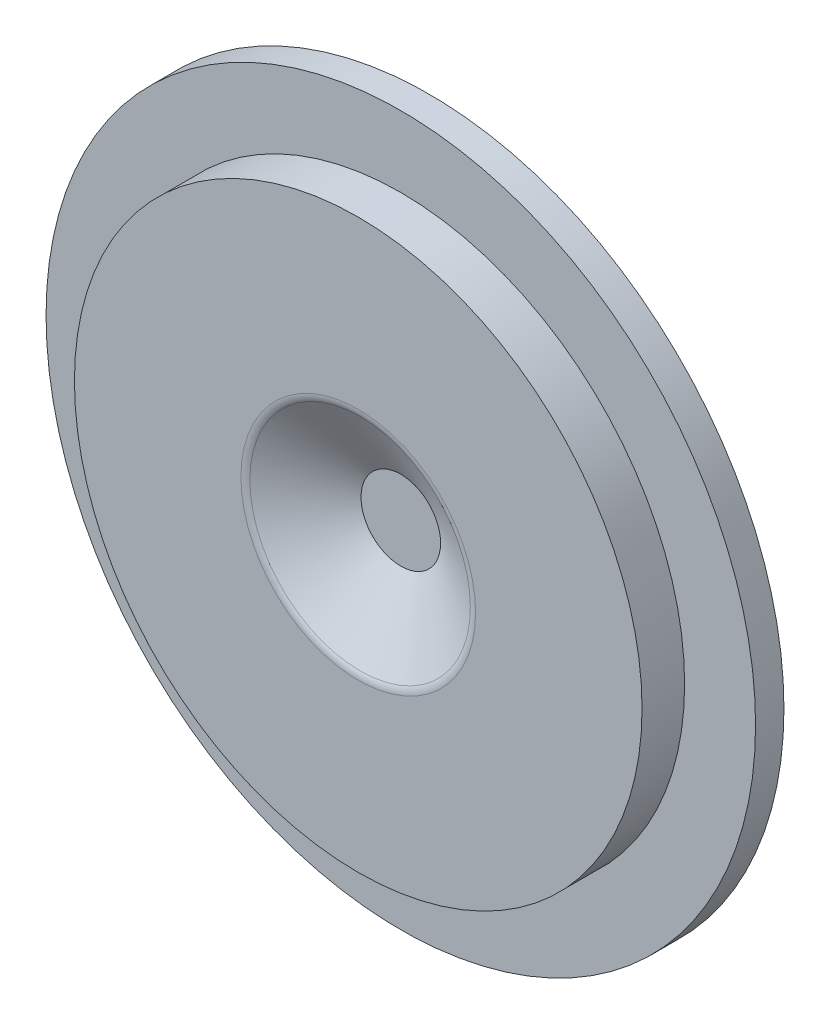
ISO-10303-21;
HEADER;
FILE_DESCRIPTION(('STEP AP214'),'2;1');
FILE_NAME('part.step','',(''),(''),'','','');
FILE_SCHEMA(('AUTOMOTIVE_DESIGN { 1 0 10303 214 1 1 1 1 }'));
ENDSEC;
DATA;
#1=APPLICATION_CONTEXT('core data for automotive mechanical design processes');
#2=APPLICATION_PROTOCOL_DEFINITION('international standard','automotive_design',2000,#1);
#3=PRODUCT_CONTEXT('',#1,'mechanical');
#4=PRODUCT('Part','Part','',(#3));
#5=PRODUCT_RELATED_PRODUCT_CATEGORY('part','',(#4));
#6=PRODUCT_DEFINITION_FORMATION('','',#4);
#7=PRODUCT_DEFINITION_CONTEXT('part definition',#1,'design');
#8=PRODUCT_DEFINITION('design','',#6,#7);
#9=PRODUCT_DEFINITION_SHAPE('','',#8);
#10=(LENGTH_UNIT() NAMED_UNIT(*) SI_UNIT(.MILLI.,.METRE.));
#11=(NAMED_UNIT(*) PLANE_ANGLE_UNIT() SI_UNIT($,.RADIAN.));
#12=(NAMED_UNIT(*) SI_UNIT($,.STERADIAN.) SOLID_ANGLE_UNIT());
#13=UNCERTAINTY_MEASURE_WITH_UNIT(LENGTH_MEASURE(1.E-05),#10,'distance_accuracy_value','');
#14=(GEOMETRIC_REPRESENTATION_CONTEXT(3) GLOBAL_UNCERTAINTY_ASSIGNED_CONTEXT((#13)) GLOBAL_UNIT_ASSIGNED_CONTEXT((#10,
#11,#12)) REPRESENTATION_CONTEXT('',''));
#15=CARTESIAN_POINT('',(0.,0.,0.));
#16=DIRECTION('',(0.,0.,1.));
#17=DIRECTION('',(1.,0.,0.));
#18=AXIS2_PLACEMENT_3D('',#15,#16,#17);
#19=CARTESIAN_POINT('',(0.,0.,25.));
#20=DIRECTION('',(0.,0.,-1.));
#21=DIRECTION('',(-1.,0.,0.));
#22=AXIS2_PLACEMENT_3D('',#19,#20,#21);
#23=CYLINDRICAL_SURFACE('',#22,100.);
#24=CARTESIAN_POINT('',(0.,0.,25.));
#25=DIRECTION('',(0.,0.,1.));
#26=DIRECTION('',(1.,0.,0.));
#27=AXIS2_PLACEMENT_3D('',#24,#25,#26);
#28=CIRCLE('',#27,100.);
#29=CARTESIAN_POINT('',(100.,0.,25.));
#30=VERTEX_POINT('',#29);
#31=EDGE_CURVE('E55',#30,#30,#28,.T.);
#32=ORIENTED_EDGE('',*,*,#31,.F.);
#33=EDGE_LOOP('',(#32));
#34=FACE_BOUND('',#33,.T.);
#35=CARTESIAN_POINT('',(0.,0.,10.));
#36=DIRECTION('',(0.,0.,-1.));
#37=DIRECTION('',(-1.,0.,0.));
#38=AXIS2_PLACEMENT_3D('',#35,#36,#37);
#39=CIRCLE('',#38,100.);
#40=CARTESIAN_POINT('',(-100.,0.,10.));
#41=VERTEX_POINT('',#40);
#42=EDGE_CURVE('E10',#41,#41,#39,.T.);
#43=ORIENTED_EDGE('',*,*,#42,.F.);
#44=EDGE_LOOP('',(#43));
#45=FACE_BOUND('',#44,.T.);
#46=ADVANCED_FACE('F38',(#34,#45),#23,.T.);
#47=CARTESIAN_POINT('',(0.,0.,25.));
#48=DIRECTION('',(0.,0.,1.));
#49=DIRECTION('',(1.,0.,0.));
#50=AXIS2_PLACEMENT_3D('',#47,#48,#49);
#51=CONICAL_SURFACE('',#50,40.,1.0471975511966);
#52=CARTESIAN_POINT('',(0.,0.,24.3301270189222));
#53=DIRECTION('',(0.,0.,1.));
#54=DIRECTION('',(1.,0.,0.));
#55=AXIS2_PLACEMENT_3D('',#52,#53,#54);
#56=CIRCLE('',#55,38.8397459621556);
#57=CARTESIAN_POINT('',(38.8397459621556,0.,24.3301270189222));
#58=VERTEX_POINT('',#57);
#59=EDGE_CURVE('E58',#58,#58,#56,.T.);
#60=ORIENTED_EDGE('',*,*,#59,.T.);
#61=EDGE_LOOP('',(#60));
#62=FACE_BOUND('',#61,.T.);
#63=CARTESIAN_POINT('',(0.,0.,10.));
#64=DIRECTION('',(0.,0.,-1.));
#65=DIRECTION('',(-1.,0.,0.));
#66=AXIS2_PLACEMENT_3D('',#63,#64,#65);
#67=CIRCLE('',#66,14.0192378864668);
#68=CARTESIAN_POINT('',(-14.0192378864668,0.,10.));
#69=VERTEX_POINT('',#68);
#70=EDGE_CURVE('E42',#69,#69,#67,.F.);
#71=ORIENTED_EDGE('',*,*,#70,.F.);
#72=EDGE_LOOP('',(#71));
#73=FACE_BOUND('',#72,.T.);
#74=ADVANCED_FACE('F72',(#62,#73),#51,.F.);
#75=CARTESIAN_POINT('',(0.,0.,25.));
#76=DIRECTION('',(0.,0.,1.));
#77=DIRECTION('',(1.,0.,0.));
#78=AXIS2_PLACEMENT_3D('',#75,#76,#77);
#79=PLANE('',#78);
#80=CARTESIAN_POINT('',(0.,0.,25.));
#81=DIRECTION('',(0.,0.,1.));
#82=DIRECTION('',(1.,0.,0.));
#83=AXIS2_PLACEMENT_3D('',#80,#81,#82);
#84=CIRCLE('',#83,41.3397459621556);
#85=CARTESIAN_POINT('',(41.3397459621556,0.,25.));
#86=VERTEX_POINT('',#85);
#87=EDGE_CURVE('E50',#86,#86,#84,.F.);
#88=ORIENTED_EDGE('',*,*,#87,.T.);
#89=EDGE_LOOP('',(#88));
#90=FACE_BOUND('',#89,.T.);
#91=ORIENTED_EDGE('',*,*,#31,.T.);
#92=EDGE_LOOP('',(#91));
#93=FACE_BOUND('',#92,.T.);
#94=ADVANCED_FACE('F64',(#90,#93),#79,.T.);
#95=CARTESIAN_POINT('',(0.,0.,20.));
#96=DIRECTION('',(0.,0.,1.));
#97=DIRECTION('',(1.,0.,0.));
#98=AXIS2_PLACEMENT_3D('',#95,#96,#97);
#99=TOROIDAL_SURFACE('',#98,41.3397459621556,5.);
#100=ORIENTED_EDGE('',*,*,#87,.F.);
#101=EDGE_LOOP('',(#100));
#102=FACE_BOUND('',#101,.T.);
#103=ORIENTED_EDGE('',*,*,#59,.F.);
#104=EDGE_LOOP('',(#103));
#105=FACE_BOUND('',#104,.T.);
#106=ADVANCED_FACE('F40',(#102,#105),#99,.T.);
#107=CARTESIAN_POINT('',(0.,0.,10.));
#108=DIRECTION('',(0.,0.,-1.));
#109=DIRECTION('',(-1.,0.,0.));
#110=AXIS2_PLACEMENT_3D('',#107,#108,#109);
#111=PLANE('',#110);
#112=ORIENTED_EDGE('',*,*,#70,.T.);
#113=EDGE_LOOP('',(#112));
#114=FACE_BOUND('',#113,.T.);
#115=ADVANCED_FACE('F69',(#114),#111,.F.);
#116=CARTESIAN_POINT('',(0.,0.,10.));
#117=DIRECTION('',(0.,0.,-1.));
#118=DIRECTION('',(-1.,0.,0.));
#119=AXIS2_PLACEMENT_3D('',#116,#117,#118);
#120=CIRCLE('',#119,125.);
#121=CARTESIAN_POINT('',(-125.,0.,10.));
#122=VERTEX_POINT('',#121);
#123=EDGE_CURVE('E59',#122,#122,#120,.T.);
#124=ORIENTED_EDGE('',*,*,#123,.F.);
#125=EDGE_LOOP('',(#124));
#126=FACE_BOUND('',#125,.T.);
#127=ORIENTED_EDGE('',*,*,#42,.T.);
#128=EDGE_LOOP('',(#127));
#129=FACE_BOUND('',#128,.T.);
#130=ADVANCED_FACE('F79',(#126,#129),#111,.F.);
#131=CARTESIAN_POINT('',(0.,0.,10.));
#132=DIRECTION('',(0.,0.,-1.));
#133=DIRECTION('',(-1.,0.,0.));
#134=AXIS2_PLACEMENT_3D('',#131,#132,#133);
#135=CYLINDRICAL_SURFACE('',#134,125.);
#136=ORIENTED_EDGE('',*,*,#123,.T.);
#137=EDGE_LOOP('',(#136));
#138=FACE_BOUND('',#137,.T.);
#139=CARTESIAN_POINT('',(0.,0.,0.));
#140=DIRECTION('',(0.,0.,-1.));
#141=DIRECTION('',(-1.,0.,0.));
#142=AXIS2_PLACEMENT_3D('',#139,#140,#141);
#143=CIRCLE('',#142,125.);
#144=CARTESIAN_POINT('',(-125.,0.,0.));
#145=VERTEX_POINT('',#144);
#146=EDGE_CURVE('E53',#145,#145,#143,.T.);
#147=ORIENTED_EDGE('',*,*,#146,.F.);
#148=EDGE_LOOP('',(#147));
#149=FACE_BOUND('',#148,.T.);
#150=ADVANCED_FACE('F84',(#138,#149),#135,.T.);
#151=CARTESIAN_POINT('',(0.,0.,0.));
#152=DIRECTION('',(0.,0.,1.));
#153=DIRECTION('',(1.,0.,0.));
#154=AXIS2_PLACEMENT_3D('',#151,#152,#153);
#155=PLANE('',#154);
#156=ORIENTED_EDGE('',*,*,#146,.T.);
#157=EDGE_LOOP('',(#156));
#158=FACE_BOUND('',#157,.T.);
#159=ADVANCED_FACE('F94',(#158),#155,.F.);
#160=CLOSED_SHELL('',(#46,#74,#94,#106,#115,#130,#150,#159));
#161=MANIFOLD_SOLID_BREP('B2',#160);
#162=ADVANCED_BREP_SHAPE_REPRESENTATION('',(#18,#161),#14);
#163=SHAPE_DEFINITION_REPRESENTATION(#9,#162);
ENDSEC;
END-ISO-10303-21;
